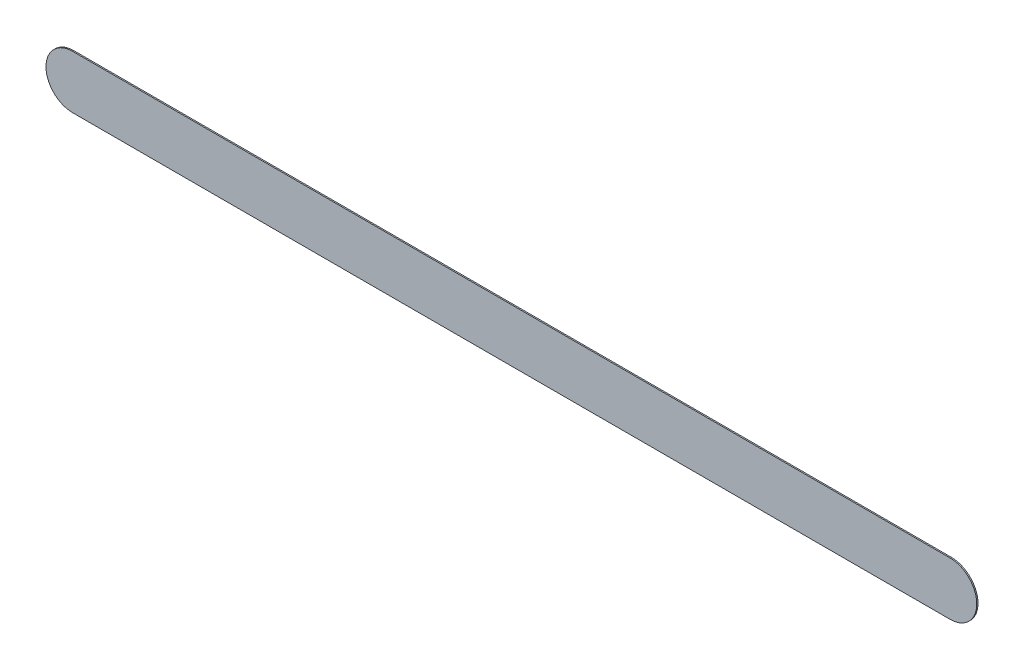
ISO-10303-21;
HEADER;
FILE_DESCRIPTION(('STEP AP214'),'2;1');
FILE_NAME('part.step','',(''),(''),'','','');
FILE_SCHEMA(('AUTOMOTIVE_DESIGN { 1 0 10303 214 1 1 1 1 }'));
ENDSEC;
DATA;
#1=APPLICATION_CONTEXT('core data for automotive mechanical design processes');
#2=APPLICATION_PROTOCOL_DEFINITION('international standard','automotive_design',2000,#1);
#3=PRODUCT_CONTEXT('',#1,'mechanical');
#4=PRODUCT('Part','Part','',(#3));
#5=PRODUCT_RELATED_PRODUCT_CATEGORY('part','',(#4));
#6=PRODUCT_DEFINITION_FORMATION('','',#4);
#7=PRODUCT_DEFINITION_CONTEXT('part definition',#1,'design');
#8=PRODUCT_DEFINITION('design','',#6,#7);
#9=PRODUCT_DEFINITION_SHAPE('','',#8);
#10=(LENGTH_UNIT() NAMED_UNIT(*) SI_UNIT(.MILLI.,.METRE.));
#11=(NAMED_UNIT(*) PLANE_ANGLE_UNIT() SI_UNIT($,.RADIAN.));
#12=(NAMED_UNIT(*) SI_UNIT($,.STERADIAN.) SOLID_ANGLE_UNIT());
#13=UNCERTAINTY_MEASURE_WITH_UNIT(LENGTH_MEASURE(1.E-05),#10,'distance_accuracy_value','');
#14=(GEOMETRIC_REPRESENTATION_CONTEXT(3) GLOBAL_UNCERTAINTY_ASSIGNED_CONTEXT((#13)) GLOBAL_UNIT_ASSIGNED_CONTEXT((#10,
#11,#12)) REPRESENTATION_CONTEXT('',''));
#15=CARTESIAN_POINT('',(0.,0.,0.));
#16=DIRECTION('',(0.,0.,1.));
#17=DIRECTION('',(1.,0.,0.));
#18=AXIS2_PLACEMENT_3D('',#15,#16,#17);
#19=CARTESIAN_POINT('',(151.892,-118.63,0.));
#20=DIRECTION('',(0.,0.,1.));
#21=DIRECTION('',(1.,0.,0.));
#22=AXIS2_PLACEMENT_3D('',#19,#20,#21);
#23=PLANE('',#22);
#24=DIRECTION('',(-1.,0.,0.));
#25=VECTOR('',#24,1.);
#26=CARTESIAN_POINT('',(151.892,-118.63,0.));
#27=LINE('',#26,#25);
#28=CARTESIAN_POINT('',(151.892,-118.63,0.));
#29=VERTEX_POINT('',#28);
#30=CARTESIAN_POINT('',(127.127,-118.63,0.));
#31=VERTEX_POINT('',#30);
#32=EDGE_CURVE('E81',#29,#31,#27,.T.);
#33=ORIENTED_EDGE('',*,*,#32,.T.);
#34=CARTESIAN_POINT('',(127.127,-119.38,0.));
#35=DIRECTION('',(0.,0.,1.));
#36=DIRECTION('',(0.,1.,0.));
#37=AXIS2_PLACEMENT_3D('',#34,#35,#36);
#38=CIRCLE('',#37,0.75);
#39=CARTESIAN_POINT('',(127.127,-120.13,0.));
#40=VERTEX_POINT('',#39);
#41=EDGE_CURVE('E102',#31,#40,#38,.T.);
#42=ORIENTED_EDGE('',*,*,#41,.T.);
#43=DIRECTION('',(1.,0.,0.));
#44=VECTOR('',#43,1.);
#45=CARTESIAN_POINT('',(127.127,-120.13,0.));
#46=LINE('',#45,#44);
#47=CARTESIAN_POINT('',(151.892,-120.13,0.));
#48=VERTEX_POINT('',#47);
#49=EDGE_CURVE('E74',#40,#48,#46,.T.);
#50=ORIENTED_EDGE('',*,*,#49,.T.);
#51=CARTESIAN_POINT('',(151.892,-119.38,0.));
#52=DIRECTION('',(0.,0.,1.));
#53=DIRECTION('',(0.,-1.,0.));
#54=AXIS2_PLACEMENT_3D('',#51,#52,#53);
#55=CIRCLE('',#54,0.75);
#56=EDGE_CURVE('E11',#48,#29,#55,.T.);
#57=ORIENTED_EDGE('',*,*,#56,.T.);
#58=EDGE_LOOP('',(#33,#42,#50,#57));
#59=FACE_BOUND('',#58,.T.);
#60=ADVANCED_FACE('F17',(#59),#23,.T.);
#61=CARTESIAN_POINT('',(151.892,-118.63,-0.035));
#62=DIRECTION('',(0.,0.,1.));
#63=DIRECTION('',(1.,0.,0.));
#64=AXIS2_PLACEMENT_3D('',#61,#62,#63);
#65=PLANE('',#64);
#66=CARTESIAN_POINT('',(151.892,-119.38,-0.035));
#67=DIRECTION('',(0.,0.,1.));
#68=DIRECTION('',(0.,-1.,0.));
#69=AXIS2_PLACEMENT_3D('',#66,#67,#68);
#70=CIRCLE('',#69,0.75);
#71=CARTESIAN_POINT('',(151.892,-120.13,-0.035));
#72=VERTEX_POINT('',#71);
#73=CARTESIAN_POINT('',(151.892,-118.63,-0.035));
#74=VERTEX_POINT('',#73);
#75=EDGE_CURVE('E25',#72,#74,#70,.T.);
#76=ORIENTED_EDGE('',*,*,#75,.F.);
#77=DIRECTION('',(1.,0.,0.));
#78=VECTOR('',#77,1.);
#79=CARTESIAN_POINT('',(127.127,-120.13,-0.035));
#80=LINE('',#79,#78);
#81=CARTESIAN_POINT('',(127.127,-120.13,-0.035));
#82=VERTEX_POINT('',#81);
#83=EDGE_CURVE('E99',#82,#72,#80,.T.);
#84=ORIENTED_EDGE('',*,*,#83,.F.);
#85=CARTESIAN_POINT('',(127.127,-119.38,-0.035));
#86=DIRECTION('',(0.,0.,1.));
#87=DIRECTION('',(0.,1.,0.));
#88=AXIS2_PLACEMENT_3D('',#85,#86,#87);
#89=CIRCLE('',#88,0.75);
#90=CARTESIAN_POINT('',(127.127,-118.63,-0.035));
#91=VERTEX_POINT('',#90);
#92=EDGE_CURVE('E83',#91,#82,#89,.T.);
#93=ORIENTED_EDGE('',*,*,#92,.F.);
#94=DIRECTION('',(-1.,0.,0.));
#95=VECTOR('',#94,1.);
#96=CARTESIAN_POINT('',(151.892,-118.63,-0.035));
#97=LINE('',#96,#95);
#98=EDGE_CURVE('E79',#74,#91,#97,.T.);
#99=ORIENTED_EDGE('',*,*,#98,.F.);
#100=EDGE_LOOP('',(#76,#84,#93,#99));
#101=FACE_BOUND('',#100,.T.);
#102=ADVANCED_FACE('F85',(#101),#65,.F.);
#103=CARTESIAN_POINT('',(151.892,-119.38,-0.035));
#104=DIRECTION('',(0.,0.,-1.));
#105=DIRECTION('',(0.,-1.,0.));
#106=AXIS2_PLACEMENT_3D('',#103,#104,#105);
#107=CYLINDRICAL_SURFACE('',#106,0.75);
#108=ORIENTED_EDGE('',*,*,#75,.T.);
#109=DIRECTION('',(0.,0.,1.));
#110=VECTOR('',#109,1.);
#111=CARTESIAN_POINT('',(151.892,-118.63,-0.035));
#112=LINE('',#111,#110);
#113=EDGE_CURVE('E68',#74,#29,#112,.T.);
#114=ORIENTED_EDGE('',*,*,#113,.T.);
#115=ORIENTED_EDGE('',*,*,#56,.F.);
#116=DIRECTION('',(0.,0.,1.));
#117=VECTOR('',#116,1.);
#118=CARTESIAN_POINT('',(151.892,-120.13,-0.035));
#119=LINE('',#118,#117);
#120=EDGE_CURVE('E71',#72,#48,#119,.T.);
#121=ORIENTED_EDGE('',*,*,#120,.F.);
#122=EDGE_LOOP('',(#108,#114,#115,#121));
#123=FACE_BOUND('',#122,.T.);
#124=ADVANCED_FACE('F67',(#123),#107,.T.);
#125=CARTESIAN_POINT('',(127.127,-120.13,-0.035));
#126=DIRECTION('',(0.,1.,0.));
#127=DIRECTION('',(1.,0.,0.));
#128=AXIS2_PLACEMENT_3D('',#125,#126,#127);
#129=PLANE('',#128);
#130=ORIENTED_EDGE('',*,*,#83,.T.);
#131=ORIENTED_EDGE('',*,*,#120,.T.);
#132=ORIENTED_EDGE('',*,*,#49,.F.);
#133=DIRECTION('',(0.,0.,1.));
#134=VECTOR('',#133,1.);
#135=CARTESIAN_POINT('',(127.127,-120.13,-0.035));
#136=LINE('',#135,#134);
#137=EDGE_CURVE('E105',#82,#40,#136,.T.);
#138=ORIENTED_EDGE('',*,*,#137,.F.);
#139=EDGE_LOOP('',(#130,#131,#132,#138));
#140=FACE_BOUND('',#139,.T.);
#141=ADVANCED_FACE('F120',(#140),#129,.F.);
#142=CARTESIAN_POINT('',(127.127,-119.38,-0.035));
#143=DIRECTION('',(0.,0.,-1.));
#144=DIRECTION('',(0.,1.,0.));
#145=AXIS2_PLACEMENT_3D('',#142,#143,#144);
#146=CYLINDRICAL_SURFACE('',#145,0.75);
#147=ORIENTED_EDGE('',*,*,#92,.T.);
#148=ORIENTED_EDGE('',*,*,#137,.T.);
#149=ORIENTED_EDGE('',*,*,#41,.F.);
#150=DIRECTION('',(0.,0.,1.));
#151=VECTOR('',#150,1.);
#152=CARTESIAN_POINT('',(127.127,-118.63,-0.035));
#153=LINE('',#152,#151);
#154=EDGE_CURVE('E89',#91,#31,#153,.T.);
#155=ORIENTED_EDGE('',*,*,#154,.F.);
#156=EDGE_LOOP('',(#147,#148,#149,#155));
#157=FACE_BOUND('',#156,.T.);
#158=ADVANCED_FACE('F123',(#157),#146,.T.);
#159=CARTESIAN_POINT('',(151.892,-118.63,-0.035));
#160=DIRECTION('',(0.,-1.,0.));
#161=DIRECTION('',(0.,0.,-1.));
#162=AXIS2_PLACEMENT_3D('',#159,#160,#161);
#163=PLANE('',#162);
#164=ORIENTED_EDGE('',*,*,#98,.T.);
#165=ORIENTED_EDGE('',*,*,#154,.T.);
#166=ORIENTED_EDGE('',*,*,#32,.F.);
#167=ORIENTED_EDGE('',*,*,#113,.F.);
#168=EDGE_LOOP('',(#164,#165,#166,#167));
#169=FACE_BOUND('',#168,.T.);
#170=ADVANCED_FACE('F77',(#169),#163,.F.);
#171=CLOSED_SHELL('',(#60,#102,#124,#141,#158,#170));
#172=MANIFOLD_SOLID_BREP('B1',#171);
#173=ADVANCED_BREP_SHAPE_REPRESENTATION('',(#18,#172),#14);
#174=SHAPE_DEFINITION_REPRESENTATION(#9,#173);
ENDSEC;
END-ISO-10303-21;
